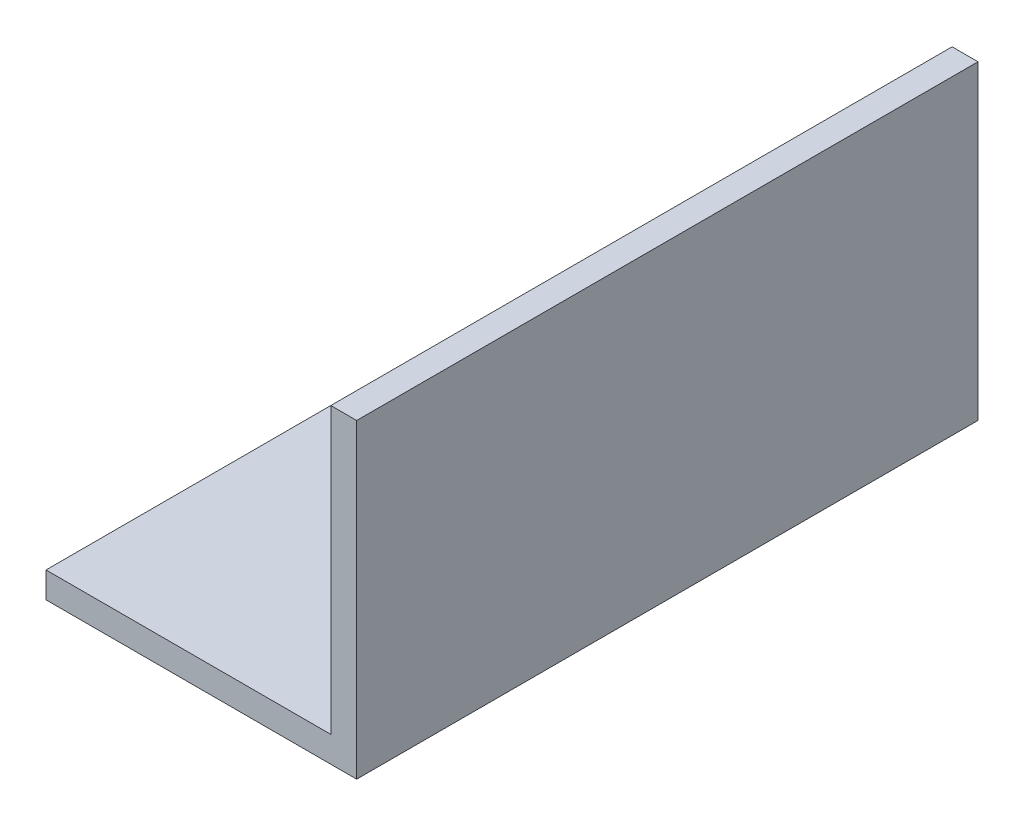
ISO-10303-21;
HEADER;
FILE_DESCRIPTION(('STEP AP214'),'2;1');
FILE_NAME('part.step','',(''),(''),'','','');
FILE_SCHEMA(('AUTOMOTIVE_DESIGN { 1 0 10303 214 1 1 1 1 }'));
ENDSEC;
DATA;
#1=APPLICATION_CONTEXT('core data for automotive mechanical design processes');
#2=APPLICATION_PROTOCOL_DEFINITION('international standard','automotive_design',2000,#1);
#3=PRODUCT_CONTEXT('',#1,'mechanical');
#4=PRODUCT('Part','Part','',(#3));
#5=PRODUCT_RELATED_PRODUCT_CATEGORY('part','',(#4));
#6=PRODUCT_DEFINITION_FORMATION('','',#4);
#7=PRODUCT_DEFINITION_CONTEXT('part definition',#1,'design');
#8=PRODUCT_DEFINITION('design','',#6,#7);
#9=PRODUCT_DEFINITION_SHAPE('','',#8);
#10=(LENGTH_UNIT() NAMED_UNIT(*) SI_UNIT(.MILLI.,.METRE.));
#11=(NAMED_UNIT(*) PLANE_ANGLE_UNIT() SI_UNIT($,.RADIAN.));
#12=(NAMED_UNIT(*) SI_UNIT($,.STERADIAN.) SOLID_ANGLE_UNIT());
#13=UNCERTAINTY_MEASURE_WITH_UNIT(LENGTH_MEASURE(1.E-05),#10,'distance_accuracy_value','');
#14=(GEOMETRIC_REPRESENTATION_CONTEXT(3) GLOBAL_UNCERTAINTY_ASSIGNED_CONTEXT((#13)) GLOBAL_UNIT_ASSIGNED_CONTEXT((#10,
#11,#12)) REPRESENTATION_CONTEXT('',''));
#15=CARTESIAN_POINT('',(0.,0.,0.));
#16=DIRECTION('',(0.,0.,1.));
#17=DIRECTION('',(1.,0.,0.));
#18=AXIS2_PLACEMENT_3D('',#15,#16,#17);
#19=CARTESIAN_POINT('',(-38.1,0.,38.1));
#20=DIRECTION('',(0.,1.,0.));
#21=DIRECTION('',(0.,0.,1.));
#22=AXIS2_PLACEMENT_3D('',#19,#20,#21);
#23=PLANE('',#22);
#24=CARTESIAN_POINT('',(-25.4,0.,0.));
#25=DIRECTION('',(0.,1.,0.));
#26=DIRECTION('',(0.,0.,1.));
#27=AXIS2_PLACEMENT_3D('',#24,#25,#26);
#28=CIRCLE('',#27,4.365625);
#29=CARTESIAN_POINT('',(-25.4,0.,4.365625));
#30=VERTEX_POINT('',#29);
#31=EDGE_CURVE('E121',#30,#30,#28,.F.);
#32=ORIENTED_EDGE('',*,*,#31,.F.);
#33=EDGE_LOOP('',(#32));
#34=FACE_BOUND('',#33,.T.);
#35=DIRECTION('',(1.,0.,0.));
#36=VECTOR('',#35,1.);
#37=CARTESIAN_POINT('',(-38.1,0.,-38.1));
#38=LINE('',#37,#36);
#39=CARTESIAN_POINT('',(-38.1,0.,-38.1));
#40=VERTEX_POINT('',#39);
#41=CARTESIAN_POINT('',(0.,0.,-38.1));
#42=VERTEX_POINT('',#41);
#43=EDGE_CURVE('E117',#40,#42,#38,.T.);
#44=ORIENTED_EDGE('',*,*,#43,.T.);
#45=DIRECTION('',(0.,0.,-1.));
#46=VECTOR('',#45,1.);
#47=CARTESIAN_POINT('',(0.,0.,38.1));
#48=LINE('',#47,#46);
#49=CARTESIAN_POINT('',(0.,0.,38.1));
#50=VERTEX_POINT('',#49);
#51=EDGE_CURVE('E11',#50,#42,#48,.T.);
#52=ORIENTED_EDGE('',*,*,#51,.F.);
#53=DIRECTION('',(1.,0.,0.));
#54=VECTOR('',#53,1.);
#55=CARTESIAN_POINT('',(-38.1,0.,38.1));
#56=LINE('',#55,#54);
#57=CARTESIAN_POINT('',(-38.1,0.,38.1));
#58=VERTEX_POINT('',#57);
#59=EDGE_CURVE('E128',#58,#50,#56,.T.);
#60=ORIENTED_EDGE('',*,*,#59,.F.);
#61=DIRECTION('',(0.,0.,-1.));
#62=VECTOR('',#61,1.);
#63=CARTESIAN_POINT('',(-38.1,0.,38.1));
#64=LINE('',#63,#62);
#65=EDGE_CURVE('E113',#58,#40,#64,.T.);
#66=ORIENTED_EDGE('',*,*,#65,.T.);
#67=EDGE_LOOP('',(#44,#52,#60,#66));
#68=FACE_BOUND('',#67,.T.);
#69=ADVANCED_FACE('F33',(#34,#68),#23,.F.);
#70=CARTESIAN_POINT('',(0.,0.,38.1));
#71=DIRECTION('',(-1.,0.,0.));
#72=DIRECTION('',(0.,-1.,0.));
#73=AXIS2_PLACEMENT_3D('',#70,#71,#72);
#74=PLANE('',#73);
#75=DIRECTION('',(0.,1.,0.));
#76=VECTOR('',#75,1.);
#77=CARTESIAN_POINT('',(0.,0.,-38.1));
#78=LINE('',#77,#76);
#79=CARTESIAN_POINT('',(0.,38.1,-38.1));
#80=VERTEX_POINT('',#79);
#81=EDGE_CURVE('E120',#42,#80,#78,.T.);
#82=ORIENTED_EDGE('',*,*,#81,.T.);
#83=DIRECTION('',(0.,0.,-1.));
#84=VECTOR('',#83,1.);
#85=CARTESIAN_POINT('',(0.,38.1,38.1));
#86=LINE('',#85,#84);
#87=CARTESIAN_POINT('',(0.,38.1,38.1));
#88=VERTEX_POINT('',#87);
#89=EDGE_CURVE('E41',#88,#80,#86,.T.);
#90=ORIENTED_EDGE('',*,*,#89,.F.);
#91=DIRECTION('',(0.,1.,0.));
#92=VECTOR('',#91,1.);
#93=CARTESIAN_POINT('',(0.,0.,38.1));
#94=LINE('',#93,#92);
#95=EDGE_CURVE('E86',#50,#88,#94,.T.);
#96=ORIENTED_EDGE('',*,*,#95,.F.);
#97=ORIENTED_EDGE('',*,*,#51,.T.);
#98=EDGE_LOOP('',(#82,#90,#96,#97));
#99=FACE_BOUND('',#98,.T.);
#100=ADVANCED_FACE('F153',(#99),#74,.F.);
#101=CARTESIAN_POINT('',(0.,38.1,38.1));
#102=DIRECTION('',(0.,-1.,0.));
#103=DIRECTION('',(0.,0.,-1.));
#104=AXIS2_PLACEMENT_3D('',#101,#102,#103);
#105=PLANE('',#104);
#106=DIRECTION('',(-1.,0.,0.));
#107=VECTOR('',#106,1.);
#108=CARTESIAN_POINT('',(0.,38.1,-38.1));
#109=LINE('',#108,#107);
#110=CARTESIAN_POINT('',(-3.175,38.1,-38.1));
#111=VERTEX_POINT('',#110);
#112=EDGE_CURVE('E123',#80,#111,#109,.T.);
#113=ORIENTED_EDGE('',*,*,#112,.T.);
#114=DIRECTION('',(0.,0.,-1.));
#115=VECTOR('',#114,1.);
#116=CARTESIAN_POINT('',(-3.175,38.1,38.1));
#117=LINE('',#116,#115);
#118=CARTESIAN_POINT('',(-3.175,38.1,38.1));
#119=VERTEX_POINT('',#118);
#120=EDGE_CURVE('E108',#119,#111,#117,.T.);
#121=ORIENTED_EDGE('',*,*,#120,.F.);
#122=DIRECTION('',(-1.,0.,0.));
#123=VECTOR('',#122,1.);
#124=CARTESIAN_POINT('',(0.,38.1,38.1));
#125=LINE('',#124,#123);
#126=EDGE_CURVE('E99',#88,#119,#125,.T.);
#127=ORIENTED_EDGE('',*,*,#126,.F.);
#128=ORIENTED_EDGE('',*,*,#89,.T.);
#129=EDGE_LOOP('',(#113,#121,#127,#128));
#130=FACE_BOUND('',#129,.T.);
#131=ADVANCED_FACE('F134',(#130),#105,.F.);
#132=CARTESIAN_POINT('',(-3.175,38.1,38.1));
#133=DIRECTION('',(1.,0.,0.));
#134=DIRECTION('',(0.,0.,-1.));
#135=AXIS2_PLACEMENT_3D('',#132,#133,#134);
#136=PLANE('',#135);
#137=DIRECTION('',(0.,-1.,0.));
#138=VECTOR('',#137,1.);
#139=CARTESIAN_POINT('',(-3.175,38.1,-38.1));
#140=LINE('',#139,#138);
#141=CARTESIAN_POINT('',(-3.175,3.175,-38.1));
#142=VERTEX_POINT('',#141);
#143=EDGE_CURVE('E107',#111,#142,#140,.T.);
#144=ORIENTED_EDGE('',*,*,#143,.T.);
#145=DIRECTION('',(0.,0.,-1.));
#146=VECTOR('',#145,1.);
#147=CARTESIAN_POINT('',(-3.175,3.175,38.1));
#148=LINE('',#147,#146);
#149=CARTESIAN_POINT('',(-3.175,3.175,38.1));
#150=VERTEX_POINT('',#149);
#151=EDGE_CURVE('E104',#150,#142,#148,.T.);
#152=ORIENTED_EDGE('',*,*,#151,.F.);
#153=DIRECTION('',(0.,-1.,0.));
#154=VECTOR('',#153,1.);
#155=CARTESIAN_POINT('',(-3.175,38.1,38.1));
#156=LINE('',#155,#154);
#157=EDGE_CURVE('E93',#119,#150,#156,.T.);
#158=ORIENTED_EDGE('',*,*,#157,.F.);
#159=ORIENTED_EDGE('',*,*,#120,.T.);
#160=EDGE_LOOP('',(#144,#152,#158,#159));
#161=FACE_BOUND('',#160,.T.);
#162=ADVANCED_FACE('F105',(#161),#136,.F.);
#163=CARTESIAN_POINT('',(-3.175,3.175,38.1));
#164=DIRECTION('',(0.,-1.,0.));
#165=DIRECTION('',(1.,0.,0.));
#166=AXIS2_PLACEMENT_3D('',#163,#164,#165);
#167=PLANE('',#166);
#168=CARTESIAN_POINT('',(-25.4,3.175,0.));
#169=DIRECTION('',(0.,1.,0.));
#170=DIRECTION('',(-1.,0.,0.));
#171=AXIS2_PLACEMENT_3D('',#168,#169,#170);
#172=CIRCLE('',#171,4.365625);
#173=CARTESIAN_POINT('',(-29.765625,3.175,0.));
#174=VERTEX_POINT('',#173);
#175=EDGE_CURVE('E161',#174,#174,#172,.T.);
#176=ORIENTED_EDGE('',*,*,#175,.F.);
#177=EDGE_LOOP('',(#176));
#178=FACE_BOUND('',#177,.T.);
#179=DIRECTION('',(-1.,0.,0.));
#180=VECTOR('',#179,1.);
#181=CARTESIAN_POINT('',(-3.175,3.175,-38.1));
#182=LINE('',#181,#180);
#183=CARTESIAN_POINT('',(-38.1,3.175,-38.1));
#184=VERTEX_POINT('',#183);
#185=EDGE_CURVE('E72',#142,#184,#182,.T.);
#186=ORIENTED_EDGE('',*,*,#185,.T.);
#187=DIRECTION('',(0.,0.,-1.));
#188=VECTOR('',#187,1.);
#189=CARTESIAN_POINT('',(-38.1,3.175,38.1));
#190=LINE('',#189,#188);
#191=CARTESIAN_POINT('',(-38.1,3.175,38.1));
#192=VERTEX_POINT('',#191);
#193=EDGE_CURVE('E109',#192,#184,#190,.T.);
#194=ORIENTED_EDGE('',*,*,#193,.F.);
#195=DIRECTION('',(-1.,0.,0.));
#196=VECTOR('',#195,1.);
#197=CARTESIAN_POINT('',(-3.175,3.175,38.1));
#198=LINE('',#197,#196);
#199=EDGE_CURVE('E97',#150,#192,#198,.T.);
#200=ORIENTED_EDGE('',*,*,#199,.F.);
#201=ORIENTED_EDGE('',*,*,#151,.T.);
#202=EDGE_LOOP('',(#186,#194,#200,#201));
#203=FACE_BOUND('',#202,.T.);
#204=ADVANCED_FACE('F111',(#178,#203),#167,.F.);
#205=CARTESIAN_POINT('',(-38.1,3.175,38.1));
#206=DIRECTION('',(1.,0.,0.));
#207=DIRECTION('',(0.,0.,-1.));
#208=AXIS2_PLACEMENT_3D('',#205,#206,#207);
#209=PLANE('',#208);
#210=DIRECTION('',(0.,-1.,0.));
#211=VECTOR('',#210,1.);
#212=CARTESIAN_POINT('',(-38.1,3.175,-38.1));
#213=LINE('',#212,#211);
#214=EDGE_CURVE('E78',#184,#40,#213,.T.);
#215=ORIENTED_EDGE('',*,*,#214,.T.);
#216=ORIENTED_EDGE('',*,*,#65,.F.);
#217=DIRECTION('',(0.,-1.,0.));
#218=VECTOR('',#217,1.);
#219=CARTESIAN_POINT('',(-38.1,3.175,38.1));
#220=LINE('',#219,#218);
#221=EDGE_CURVE('E49',#192,#58,#220,.T.);
#222=ORIENTED_EDGE('',*,*,#221,.F.);
#223=ORIENTED_EDGE('',*,*,#193,.T.);
#224=EDGE_LOOP('',(#215,#216,#222,#223));
#225=FACE_BOUND('',#224,.T.);
#226=ADVANCED_FACE('F141',(#225),#209,.F.);
#227=CARTESIAN_POINT('',(0.,0.,38.1));
#228=DIRECTION('',(0.,0.,1.));
#229=DIRECTION('',(1.,0.,0.));
#230=AXIS2_PLACEMENT_3D('',#227,#228,#229);
#231=PLANE('',#230);
#232=ORIENTED_EDGE('',*,*,#59,.T.);
#233=ORIENTED_EDGE('',*,*,#95,.T.);
#234=ORIENTED_EDGE('',*,*,#126,.T.);
#235=ORIENTED_EDGE('',*,*,#157,.T.);
#236=ORIENTED_EDGE('',*,*,#199,.T.);
#237=ORIENTED_EDGE('',*,*,#221,.T.);
#238=EDGE_LOOP('',(#232,#233,#234,#235,#236,#237));
#239=FACE_BOUND('',#238,.T.);
#240=ADVANCED_FACE('F95',(#239),#231,.T.);
#241=CARTESIAN_POINT('',(0.,0.,-38.1));
#242=DIRECTION('',(0.,0.,1.));
#243=DIRECTION('',(1.,0.,0.));
#244=AXIS2_PLACEMENT_3D('',#241,#242,#243);
#245=PLANE('',#244);
#246=ORIENTED_EDGE('',*,*,#43,.F.);
#247=ORIENTED_EDGE('',*,*,#214,.F.);
#248=ORIENTED_EDGE('',*,*,#185,.F.);
#249=ORIENTED_EDGE('',*,*,#143,.F.);
#250=ORIENTED_EDGE('',*,*,#112,.F.);
#251=ORIENTED_EDGE('',*,*,#81,.F.);
#252=EDGE_LOOP('',(#246,#247,#248,#249,#250,#251));
#253=FACE_BOUND('',#252,.T.);
#254=ADVANCED_FACE('F137',(#253),#245,.F.);
#255=CARTESIAN_POINT('',(-25.4,-0.0010000000000036,0.));
#256=DIRECTION('',(0.,1.,0.));
#257=DIRECTION('',(-1.,0.,0.));
#258=AXIS2_PLACEMENT_3D('',#255,#256,#257);
#259=CYLINDRICAL_SURFACE('',#258,4.365625);
#260=ORIENTED_EDGE('',*,*,#175,.T.);
#261=EDGE_LOOP('',(#260));
#262=FACE_BOUND('',#261,.T.);
#263=ORIENTED_EDGE('',*,*,#31,.T.);
#264=EDGE_LOOP('',(#263));
#265=FACE_BOUND('',#264,.T.);
#266=ADVANCED_FACE('F169',(#262,#265),#259,.F.);
#267=CLOSED_SHELL('',(#69,#100,#131,#162,#204,#226,#240,#254,#266));
#268=MANIFOLD_SOLID_BREP('B2',#267);
#269=ADVANCED_BREP_SHAPE_REPRESENTATION('',(#18,#268),#14);
#270=SHAPE_DEFINITION_REPRESENTATION(#9,#269);
ENDSEC;
END-ISO-10303-21;
